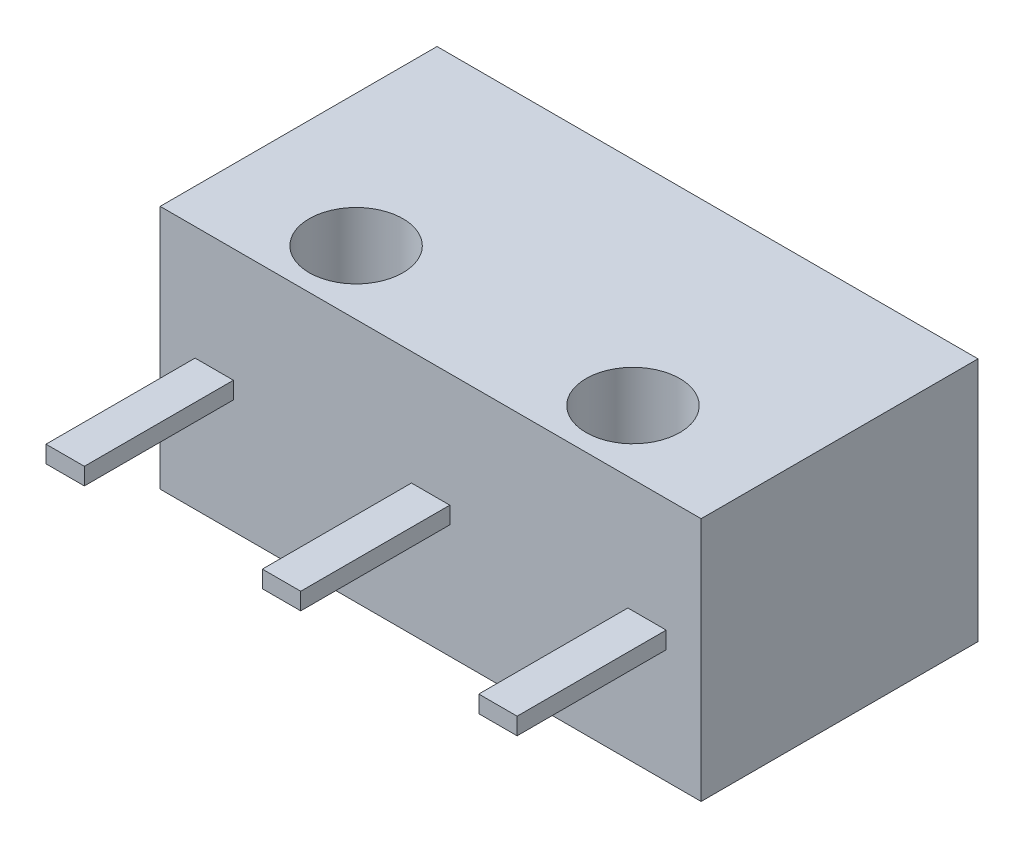
ISO-10303-21;
HEADER;
FILE_DESCRIPTION(('STEP AP214'),'2;1');
FILE_NAME('part.step','',(''),(''),'','','');
FILE_SCHEMA(('AUTOMOTIVE_DESIGN { 1 0 10303 214 1 1 1 1 }'));
ENDSEC;
DATA;
#1=APPLICATION_CONTEXT('core data for automotive mechanical design processes');
#2=APPLICATION_PROTOCOL_DEFINITION('international standard','automotive_design',2000,#1);
#3=PRODUCT_CONTEXT('',#1,'mechanical');
#4=PRODUCT('Part','Part','',(#3));
#5=PRODUCT_RELATED_PRODUCT_CATEGORY('part','',(#4));
#6=PRODUCT_DEFINITION_FORMATION('','',#4);
#7=PRODUCT_DEFINITION_CONTEXT('part definition',#1,'design');
#8=PRODUCT_DEFINITION('design','',#6,#7);
#9=PRODUCT_DEFINITION_SHAPE('','',#8);
#10=(LENGTH_UNIT() NAMED_UNIT(*) SI_UNIT(.MILLI.,.METRE.));
#11=(NAMED_UNIT(*) PLANE_ANGLE_UNIT() SI_UNIT($,.RADIAN.));
#12=(NAMED_UNIT(*) SI_UNIT($,.STERADIAN.) SOLID_ANGLE_UNIT());
#13=UNCERTAINTY_MEASURE_WITH_UNIT(LENGTH_MEASURE(1.E-05),#10,'distance_accuracy_value','');
#14=(GEOMETRIC_REPRESENTATION_CONTEXT(3) GLOBAL_UNCERTAINTY_ASSIGNED_CONTEXT((#13)) GLOBAL_UNIT_ASSIGNED_CONTEXT((#10,
#11,#12)) REPRESENTATION_CONTEXT('',''));
#15=CARTESIAN_POINT('',(0.,0.,0.));
#16=DIRECTION('',(0.,0.,1.));
#17=DIRECTION('',(1.,0.,0.));
#18=AXIS2_PLACEMENT_3D('',#15,#16,#17);
#19=CARTESIAN_POINT('',(0.,5.75,0.));
#20=DIRECTION('',(0.,0.,-1.));
#21=DIRECTION('',(-1.,0.,0.));
#22=AXIS2_PLACEMENT_3D('',#19,#20,#21);
#23=PLANE('',#22);
#24=DIRECTION('',(1.,0.,0.));
#25=VECTOR('',#24,1.);
#26=CARTESIAN_POINT('',(0.,0.,0.));
#27=LINE('',#26,#25);
#28=CARTESIAN_POINT('',(0.,0.,0.));
#29=VERTEX_POINT('',#28);
#30=CARTESIAN_POINT('',(12.7,0.,0.));
#31=VERTEX_POINT('',#30);
#32=EDGE_CURVE('E294',#29,#31,#27,.T.);
#33=ORIENTED_EDGE('',*,*,#32,.T.);
#34=DIRECTION('',(0.,-1.,0.));
#35=VECTOR('',#34,1.);
#36=CARTESIAN_POINT('',(12.7,5.75,0.));
#37=LINE('',#36,#35);
#38=CARTESIAN_POINT('',(12.7,5.75,0.));
#39=VERTEX_POINT('',#38);
#40=EDGE_CURVE('E41',#39,#31,#37,.T.);
#41=ORIENTED_EDGE('',*,*,#40,.F.);
#42=DIRECTION('',(1.,0.,0.));
#43=VECTOR('',#42,1.);
#44=CARTESIAN_POINT('',(0.,5.75,0.));
#45=LINE('',#44,#43);
#46=CARTESIAN_POINT('',(0.,5.75,0.));
#47=VERTEX_POINT('',#46);
#48=EDGE_CURVE('E284',#47,#39,#45,.T.);
#49=ORIENTED_EDGE('',*,*,#48,.F.);
#50=DIRECTION('',(0.,-1.,0.));
#51=VECTOR('',#50,1.);
#52=CARTESIAN_POINT('',(0.,5.75,0.));
#53=LINE('',#52,#51);
#54=EDGE_CURVE('E11',#47,#29,#53,.T.);
#55=ORIENTED_EDGE('',*,*,#54,.T.);
#56=EDGE_LOOP('',(#33,#41,#49,#55));
#57=FACE_BOUND('',#56,.T.);
#58=DIRECTION('',(0.,1.,0.));
#59=VECTOR('',#58,1.);
#60=CARTESIAN_POINT('',(6.8,2.675,0.));
#61=LINE('',#60,#59);
#62=CARTESIAN_POINT('',(6.8,2.675,0.));
#63=VERTEX_POINT('',#62);
#64=CARTESIAN_POINT('',(6.8,3.075,0.));
#65=VERTEX_POINT('',#64);
#66=EDGE_CURVE('E263',#63,#65,#61,.T.);
#67=ORIENTED_EDGE('',*,*,#66,.F.);
#68=DIRECTION('',(-1.,0.,0.));
#69=VECTOR('',#68,1.);
#70=CARTESIAN_POINT('',(5.9,2.675,0.));
#71=LINE('',#70,#69);
#72=CARTESIAN_POINT('',(5.9,2.675,0.));
#73=VERTEX_POINT('',#72);
#74=EDGE_CURVE('E257',#63,#73,#71,.T.);
#75=ORIENTED_EDGE('',*,*,#74,.T.);
#76=DIRECTION('',(0.,1.,0.));
#77=VECTOR('',#76,1.);
#78=CARTESIAN_POINT('',(5.9,2.675,0.));
#79=LINE('',#78,#77);
#80=CARTESIAN_POINT('',(5.9,3.075,0.));
#81=VERTEX_POINT('',#80);
#82=EDGE_CURVE('E260',#73,#81,#79,.T.);
#83=ORIENTED_EDGE('',*,*,#82,.T.);
#84=DIRECTION('',(-1.,0.,0.));
#85=VECTOR('',#84,1.);
#86=CARTESIAN_POINT('',(5.9,3.075,0.));
#87=LINE('',#86,#85);
#88=EDGE_CURVE('E245',#65,#81,#87,.T.);
#89=ORIENTED_EDGE('',*,*,#88,.F.);
#90=EDGE_LOOP('',(#67,#75,#83,#89));
#91=FACE_BOUND('',#90,.T.);
#92=DIRECTION('',(0.,1.,0.));
#93=VECTOR('',#92,1.);
#94=CARTESIAN_POINT('',(11.88,2.675,0.));
#95=LINE('',#94,#93);
#96=CARTESIAN_POINT('',(11.88,2.675,0.));
#97=VERTEX_POINT('',#96);
#98=CARTESIAN_POINT('',(11.88,3.075,0.));
#99=VERTEX_POINT('',#98);
#100=EDGE_CURVE('E233',#97,#99,#95,.T.);
#101=ORIENTED_EDGE('',*,*,#100,.F.);
#102=DIRECTION('',(-1.,0.,0.));
#103=VECTOR('',#102,1.);
#104=CARTESIAN_POINT('',(11.88,2.675,0.));
#105=LINE('',#104,#103);
#106=CARTESIAN_POINT('',(10.98,2.675,0.));
#107=VERTEX_POINT('',#106);
#108=EDGE_CURVE('E222',#97,#107,#105,.T.);
#109=ORIENTED_EDGE('',*,*,#108,.T.);
#110=DIRECTION('',(0.,1.,0.));
#111=VECTOR('',#110,1.);
#112=CARTESIAN_POINT('',(10.98,2.675,0.));
#113=LINE('',#112,#111);
#114=CARTESIAN_POINT('',(10.98,3.075,0.));
#115=VERTEX_POINT('',#114);
#116=EDGE_CURVE('E231',#107,#115,#113,.T.);
#117=ORIENTED_EDGE('',*,*,#116,.T.);
#118=DIRECTION('',(-1.,0.,0.));
#119=VECTOR('',#118,1.);
#120=CARTESIAN_POINT('',(11.88,3.075,0.));
#121=LINE('',#120,#119);
#122=EDGE_CURVE('E211',#99,#115,#121,.T.);
#123=ORIENTED_EDGE('',*,*,#122,.F.);
#124=EDGE_LOOP('',(#101,#109,#117,#123));
#125=FACE_BOUND('',#124,.T.);
#126=DIRECTION('',(-1.,0.,0.));
#127=VECTOR('',#126,1.);
#128=CARTESIAN_POINT('',(0.820000000000001,2.675,0.));
#129=LINE('',#128,#127);
#130=CARTESIAN_POINT('',(1.72,2.675,0.));
#131=VERTEX_POINT('',#130);
#132=CARTESIAN_POINT('',(0.820000000000001,2.675,0.));
#133=VERTEX_POINT('',#132);
#134=EDGE_CURVE('E192',#131,#133,#129,.T.);
#135=ORIENTED_EDGE('',*,*,#134,.T.);
#136=DIRECTION('',(0.,1.,0.));
#137=VECTOR('',#136,1.);
#138=CARTESIAN_POINT('',(0.820000000000001,2.675,0.));
#139=LINE('',#138,#137);
#140=CARTESIAN_POINT('',(0.820000000000001,3.075,0.));
#141=VERTEX_POINT('',#140);
#142=EDGE_CURVE('E196',#133,#141,#139,.T.);
#143=ORIENTED_EDGE('',*,*,#142,.T.);
#144=DIRECTION('',(-1.,0.,0.));
#145=VECTOR('',#144,1.);
#146=CARTESIAN_POINT('',(0.820000000000001,3.075,0.));
#147=LINE('',#146,#145);
#148=CARTESIAN_POINT('',(1.72,3.075,0.));
#149=VERTEX_POINT('',#148);
#150=EDGE_CURVE('E183',#149,#141,#147,.T.);
#151=ORIENTED_EDGE('',*,*,#150,.F.);
#152=DIRECTION('',(0.,1.,0.));
#153=VECTOR('',#152,1.);
#154=CARTESIAN_POINT('',(1.72,2.675,0.));
#155=LINE('',#154,#153);
#156=EDGE_CURVE('E200',#131,#149,#155,.T.);
#157=ORIENTED_EDGE('',*,*,#156,.F.);
#158=EDGE_LOOP('',(#135,#143,#151,#157));
#159=FACE_BOUND('',#158,.T.);
#160=ADVANCED_FACE('F33',(#57,#91,#125,#159),#23,.F.);
#161=CARTESIAN_POINT('',(0.,5.75,0.));
#162=DIRECTION('',(1.,0.,0.));
#163=DIRECTION('',(0.,0.,-1.));
#164=AXIS2_PLACEMENT_3D('',#161,#162,#163);
#165=PLANE('',#164);
#166=DIRECTION('',(0.,0.,1.));
#167=VECTOR('',#166,1.);
#168=CARTESIAN_POINT('',(0.,0.,0.));
#169=LINE('',#168,#167);
#170=CARTESIAN_POINT('',(0.,0.,-6.5));
#171=VERTEX_POINT('',#170);
#172=EDGE_CURVE('E272',#171,#29,#169,.T.);
#173=ORIENTED_EDGE('',*,*,#172,.T.);
#174=ORIENTED_EDGE('',*,*,#54,.F.);
#175=DIRECTION('',(0.,0.,1.));
#176=VECTOR('',#175,1.);
#177=CARTESIAN_POINT('',(0.,5.75,0.));
#178=LINE('',#177,#176);
#179=CARTESIAN_POINT('',(0.,5.75,-6.5));
#180=VERTEX_POINT('',#179);
#181=EDGE_CURVE('E281',#180,#47,#178,.T.);
#182=ORIENTED_EDGE('',*,*,#181,.F.);
#183=DIRECTION('',(0.,-1.,0.));
#184=VECTOR('',#183,1.);
#185=CARTESIAN_POINT('',(0.,5.75,-6.5));
#186=LINE('',#185,#184);
#187=EDGE_CURVE('E291',#180,#171,#186,.T.);
#188=ORIENTED_EDGE('',*,*,#187,.T.);
#189=EDGE_LOOP('',(#173,#174,#182,#188));
#190=FACE_BOUND('',#189,.T.);
#191=ADVANCED_FACE('F35',(#190),#165,.F.);
#192=CARTESIAN_POINT('',(12.7,5.75,0.));
#193=DIRECTION('',(-1.,0.,0.));
#194=DIRECTION('',(0.,0.,1.));
#195=AXIS2_PLACEMENT_3D('',#192,#193,#194);
#196=PLANE('',#195);
#197=DIRECTION('',(0.,0.,-1.));
#198=VECTOR('',#197,1.);
#199=CARTESIAN_POINT('',(12.7,0.,0.));
#200=LINE('',#199,#198);
#201=CARTESIAN_POINT('',(12.7,0.,-6.5));
#202=VERTEX_POINT('',#201);
#203=EDGE_CURVE('E296',#31,#202,#200,.T.);
#204=ORIENTED_EDGE('',*,*,#203,.T.);
#205=DIRECTION('',(0.,-1.,0.));
#206=VECTOR('',#205,1.);
#207=CARTESIAN_POINT('',(12.7,5.75,-6.5));
#208=LINE('',#207,#206);
#209=CARTESIAN_POINT('',(12.7,5.75,-6.5));
#210=VERTEX_POINT('',#209);
#211=EDGE_CURVE('E301',#210,#202,#208,.T.);
#212=ORIENTED_EDGE('',*,*,#211,.F.);
#213=DIRECTION('',(0.,0.,-1.));
#214=VECTOR('',#213,1.);
#215=CARTESIAN_POINT('',(12.7,5.75,0.));
#216=LINE('',#215,#214);
#217=EDGE_CURVE('E287',#39,#210,#216,.T.);
#218=ORIENTED_EDGE('',*,*,#217,.F.);
#219=ORIENTED_EDGE('',*,*,#40,.T.);
#220=EDGE_LOOP('',(#204,#212,#218,#219));
#221=FACE_BOUND('',#220,.T.);
#222=ADVANCED_FACE('F308',(#221),#196,.F.);
#223=CARTESIAN_POINT('',(0.,5.75,-6.5));
#224=DIRECTION('',(0.,0.,1.));
#225=DIRECTION('',(1.,0.,0.));
#226=AXIS2_PLACEMENT_3D('',#223,#224,#225);
#227=PLANE('',#226);
#228=DIRECTION('',(0.,1.,0.));
#229=VECTOR('',#228,1.);
#230=CARTESIAN_POINT('',(3.8,1.425,-6.5));
#231=LINE('',#230,#229);
#232=CARTESIAN_POINT('',(3.8,1.425,-6.5));
#233=VERTEX_POINT('',#232);
#234=CARTESIAN_POINT('',(3.8,4.325,-6.5));
#235=VERTEX_POINT('',#234);
#236=EDGE_CURVE('E53',#233,#235,#231,.T.);
#237=ORIENTED_EDGE('',*,*,#236,.F.);
#238=DIRECTION('',(1.,0.,0.));
#239=VECTOR('',#238,1.);
#240=CARTESIAN_POINT('',(3.8,1.425,-6.5));
#241=LINE('',#240,#239);
#242=CARTESIAN_POINT('',(5.,1.425,-6.5));
#243=VERTEX_POINT('',#242);
#244=EDGE_CURVE('E48',#233,#243,#241,.T.);
#245=ORIENTED_EDGE('',*,*,#244,.T.);
#246=DIRECTION('',(0.,1.,0.));
#247=VECTOR('',#246,1.);
#248=CARTESIAN_POINT('',(5.,1.425,-6.5));
#249=LINE('',#248,#247);
#250=CARTESIAN_POINT('',(5.,4.325,-6.5));
#251=VERTEX_POINT('',#250);
#252=EDGE_CURVE('E154',#243,#251,#249,.T.);
#253=ORIENTED_EDGE('',*,*,#252,.T.);
#254=DIRECTION('',(1.,0.,0.));
#255=VECTOR('',#254,1.);
#256=CARTESIAN_POINT('',(3.8,4.325,-6.5));
#257=LINE('',#256,#255);
#258=EDGE_CURVE('E158',#235,#251,#257,.T.);
#259=ORIENTED_EDGE('',*,*,#258,.F.);
#260=EDGE_LOOP('',(#237,#245,#253,#259));
#261=FACE_BOUND('',#260,.T.);
#262=DIRECTION('',(-1.,0.,0.));
#263=VECTOR('',#262,1.);
#264=CARTESIAN_POINT('',(0.,0.,-6.5));
#265=LINE('',#264,#263);
#266=EDGE_CURVE('E285',#202,#171,#265,.T.);
#267=ORIENTED_EDGE('',*,*,#266,.T.);
#268=ORIENTED_EDGE('',*,*,#187,.F.);
#269=DIRECTION('',(-1.,0.,0.));
#270=VECTOR('',#269,1.);
#271=CARTESIAN_POINT('',(0.,5.75,-6.5));
#272=LINE('',#271,#270);
#273=EDGE_CURVE('E289',#210,#180,#272,.T.);
#274=ORIENTED_EDGE('',*,*,#273,.F.);
#275=ORIENTED_EDGE('',*,*,#211,.T.);
#276=EDGE_LOOP('',(#267,#268,#274,#275));
#277=FACE_BOUND('',#276,.T.);
#278=ADVANCED_FACE('F156',(#261,#277),#227,.F.);
#279=CARTESIAN_POINT('',(0.,5.75,0.));
#280=DIRECTION('',(0.,-1.,0.));
#281=DIRECTION('',(0.,0.,-1.));
#282=AXIS2_PLACEMENT_3D('',#279,#280,#281);
#283=PLANE('',#282);
#284=CARTESIAN_POINT('',(3.1,5.75,-1.5));
#285=DIRECTION('',(0.,1.,0.));
#286=DIRECTION('',(0.,0.,1.));
#287=AXIS2_PLACEMENT_3D('',#284,#285,#286);
#288=CIRCLE('',#287,1.1);
#289=CARTESIAN_POINT('',(3.1,5.75,-0.4));
#290=VERTEX_POINT('',#289);
#291=EDGE_CURVE('E273',#290,#290,#288,.T.);
#292=ORIENTED_EDGE('',*,*,#291,.F.);
#293=EDGE_LOOP('',(#292));
#294=FACE_BOUND('',#293,.T.);
#295=CARTESIAN_POINT('',(9.6,5.75,-1.5));
#296=DIRECTION('',(0.,1.,0.));
#297=DIRECTION('',(0.,0.,1.));
#298=AXIS2_PLACEMENT_3D('',#295,#296,#297);
#299=CIRCLE('',#298,1.1);
#300=CARTESIAN_POINT('',(9.6,5.75,-0.4));
#301=VERTEX_POINT('',#300);
#302=EDGE_CURVE('E262',#301,#301,#299,.T.);
#303=ORIENTED_EDGE('',*,*,#302,.F.);
#304=EDGE_LOOP('',(#303));
#305=FACE_BOUND('',#304,.T.);
#306=ORIENTED_EDGE('',*,*,#181,.T.);
#307=ORIENTED_EDGE('',*,*,#48,.T.);
#308=ORIENTED_EDGE('',*,*,#217,.T.);
#309=ORIENTED_EDGE('',*,*,#273,.T.);
#310=EDGE_LOOP('',(#306,#307,#308,#309));
#311=FACE_BOUND('',#310,.T.);
#312=ADVANCED_FACE('F321',(#294,#305,#311),#283,.F.);
#313=CARTESIAN_POINT('',(0.,0.,0.));
#314=DIRECTION('',(0.,-1.,0.));
#315=DIRECTION('',(0.,0.,-1.));
#316=AXIS2_PLACEMENT_3D('',#313,#314,#315);
#317=PLANE('',#316);
#318=CARTESIAN_POINT('',(3.1,0.,-1.5));
#319=DIRECTION('',(0.,1.,0.));
#320=DIRECTION('',(0.,0.,1.));
#321=AXIS2_PLACEMENT_3D('',#318,#319,#320);
#322=CIRCLE('',#321,1.1);
#323=CARTESIAN_POINT('',(3.1,0.,-0.4));
#324=VERTEX_POINT('',#323);
#325=EDGE_CURVE('E269',#324,#324,#322,.T.);
#326=ORIENTED_EDGE('',*,*,#325,.T.);
#327=EDGE_LOOP('',(#326));
#328=FACE_BOUND('',#327,.T.);
#329=CARTESIAN_POINT('',(9.6,0.,-1.5));
#330=DIRECTION('',(0.,1.,0.));
#331=DIRECTION('',(0.,0.,1.));
#332=AXIS2_PLACEMENT_3D('',#329,#330,#331);
#333=CIRCLE('',#332,1.1);
#334=CARTESIAN_POINT('',(9.6,0.,-0.4));
#335=VERTEX_POINT('',#334);
#336=EDGE_CURVE('E276',#335,#335,#333,.T.);
#337=ORIENTED_EDGE('',*,*,#336,.T.);
#338=EDGE_LOOP('',(#337));
#339=FACE_BOUND('',#338,.T.);
#340=ORIENTED_EDGE('',*,*,#172,.F.);
#341=ORIENTED_EDGE('',*,*,#266,.F.);
#342=ORIENTED_EDGE('',*,*,#203,.F.);
#343=ORIENTED_EDGE('',*,*,#32,.F.);
#344=EDGE_LOOP('',(#340,#341,#342,#343));
#345=FACE_BOUND('',#344,.T.);
#346=ADVANCED_FACE('F314',(#328,#339,#345),#317,.T.);
#347=CARTESIAN_POINT('',(9.6,0.,-1.5));
#348=DIRECTION('',(0.,1.,0.));
#349=DIRECTION('',(0.,0.,1.));
#350=AXIS2_PLACEMENT_3D('',#347,#348,#349);
#351=CYLINDRICAL_SURFACE('',#350,1.1);
#352=ORIENTED_EDGE('',*,*,#336,.F.);
#353=EDGE_LOOP('',(#352));
#354=FACE_BOUND('',#353,.T.);
#355=ORIENTED_EDGE('',*,*,#302,.T.);
#356=EDGE_LOOP('',(#355));
#357=FACE_BOUND('',#356,.T.);
#358=ADVANCED_FACE('F401',(#354,#357),#351,.F.);
#359=CARTESIAN_POINT('',(3.1,0.,-1.5));
#360=DIRECTION('',(0.,1.,0.));
#361=DIRECTION('',(0.,0.,1.));
#362=AXIS2_PLACEMENT_3D('',#359,#360,#361);
#363=CYLINDRICAL_SURFACE('',#362,1.1);
#364=ORIENTED_EDGE('',*,*,#325,.F.);
#365=EDGE_LOOP('',(#364));
#366=FACE_BOUND('',#365,.T.);
#367=ORIENTED_EDGE('',*,*,#291,.T.);
#368=EDGE_LOOP('',(#367));
#369=FACE_BOUND('',#368,.T.);
#370=ADVANCED_FACE('F397',(#366,#369),#363,.F.);
#371=CARTESIAN_POINT('',(5.9,2.675,3.5));
#372=DIRECTION('',(-1.,0.,0.));
#373=DIRECTION('',(0.,0.,1.));
#374=AXIS2_PLACEMENT_3D('',#371,#372,#373);
#375=PLANE('',#374);
#376=DIRECTION('',(0.,1.,0.));
#377=VECTOR('',#376,1.);
#378=CARTESIAN_POINT('',(5.9,2.675,3.5));
#379=LINE('',#378,#377);
#380=CARTESIAN_POINT('',(5.9,2.675,3.5));
#381=VERTEX_POINT('',#380);
#382=CARTESIAN_POINT('',(5.9,3.075,3.5));
#383=VERTEX_POINT('',#382);
#384=EDGE_CURVE('E259',#381,#383,#379,.T.);
#385=ORIENTED_EDGE('',*,*,#384,.T.);
#386=DIRECTION('',(0.,0.,1.));
#387=VECTOR('',#386,1.);
#388=CARTESIAN_POINT('',(5.9,3.075,3.5));
#389=LINE('',#388,#387);
#390=EDGE_CURVE('E230',#81,#383,#389,.T.);
#391=ORIENTED_EDGE('',*,*,#390,.F.);
#392=ORIENTED_EDGE('',*,*,#82,.F.);
#393=DIRECTION('',(0.,0.,1.));
#394=VECTOR('',#393,1.);
#395=CARTESIAN_POINT('',(5.9,2.675,3.5));
#396=LINE('',#395,#394);
#397=EDGE_CURVE('E248',#73,#381,#396,.T.);
#398=ORIENTED_EDGE('',*,*,#397,.T.);
#399=EDGE_LOOP('',(#385,#391,#392,#398));
#400=FACE_BOUND('',#399,.T.);
#401=ADVANCED_FACE('F390',(#400),#375,.T.);
#402=CARTESIAN_POINT('',(6.8,2.675,3.5));
#403=DIRECTION('',(1.,0.,0.));
#404=DIRECTION('',(0.,0.,-1.));
#405=AXIS2_PLACEMENT_3D('',#402,#403,#404);
#406=PLANE('',#405);
#407=ORIENTED_EDGE('',*,*,#66,.T.);
#408=DIRECTION('',(0.,0.,-1.));
#409=VECTOR('',#408,1.);
#410=CARTESIAN_POINT('',(6.8,3.075,3.5));
#411=LINE('',#410,#409);
#412=CARTESIAN_POINT('',(6.8,3.075,3.5));
#413=VERTEX_POINT('',#412);
#414=EDGE_CURVE('E242',#413,#65,#411,.T.);
#415=ORIENTED_EDGE('',*,*,#414,.F.);
#416=DIRECTION('',(0.,1.,0.));
#417=VECTOR('',#416,1.);
#418=CARTESIAN_POINT('',(6.8,2.675,3.5));
#419=LINE('',#418,#417);
#420=CARTESIAN_POINT('',(6.8,2.675,3.5));
#421=VERTEX_POINT('',#420);
#422=EDGE_CURVE('E266',#421,#413,#419,.T.);
#423=ORIENTED_EDGE('',*,*,#422,.F.);
#424=DIRECTION('',(0.,0.,-1.));
#425=VECTOR('',#424,1.);
#426=CARTESIAN_POINT('',(6.8,2.675,3.5));
#427=LINE('',#426,#425);
#428=EDGE_CURVE('E254',#421,#63,#427,.T.);
#429=ORIENTED_EDGE('',*,*,#428,.T.);
#430=EDGE_LOOP('',(#407,#415,#423,#429));
#431=FACE_BOUND('',#430,.T.);
#432=ADVANCED_FACE('F387',(#431),#406,.T.);
#433=CARTESIAN_POINT('',(5.9,2.675,3.5));
#434=DIRECTION('',(0.,0.,1.));
#435=DIRECTION('',(1.,0.,0.));
#436=AXIS2_PLACEMENT_3D('',#433,#434,#435);
#437=PLANE('',#436);
#438=ORIENTED_EDGE('',*,*,#422,.T.);
#439=DIRECTION('',(1.,0.,0.));
#440=VECTOR('',#439,1.);
#441=CARTESIAN_POINT('',(5.9,3.075,3.5));
#442=LINE('',#441,#440);
#443=EDGE_CURVE('E239',#383,#413,#442,.T.);
#444=ORIENTED_EDGE('',*,*,#443,.F.);
#445=ORIENTED_EDGE('',*,*,#384,.F.);
#446=DIRECTION('',(1.,0.,0.));
#447=VECTOR('',#446,1.);
#448=CARTESIAN_POINT('',(5.9,2.675,3.5));
#449=LINE('',#448,#447);
#450=EDGE_CURVE('E251',#381,#421,#449,.T.);
#451=ORIENTED_EDGE('',*,*,#450,.T.);
#452=EDGE_LOOP('',(#438,#444,#445,#451));
#453=FACE_BOUND('',#452,.T.);
#454=ADVANCED_FACE('F385',(#453),#437,.T.);
#455=CARTESIAN_POINT('',(0.,2.675,0.));
#456=DIRECTION('',(0.,-1.,0.));
#457=DIRECTION('',(0.,0.,-1.));
#458=AXIS2_PLACEMENT_3D('',#455,#456,#457);
#459=PLANE('',#458);
#460=ORIENTED_EDGE('',*,*,#397,.F.);
#461=ORIENTED_EDGE('',*,*,#74,.F.);
#462=ORIENTED_EDGE('',*,*,#428,.F.);
#463=ORIENTED_EDGE('',*,*,#450,.F.);
#464=EDGE_LOOP('',(#460,#461,#462,#463));
#465=FACE_BOUND('',#464,.T.);
#466=ADVANCED_FACE('F381',(#465),#459,.T.);
#467=CARTESIAN_POINT('',(0.,3.075,0.));
#468=DIRECTION('',(0.,-1.,0.));
#469=DIRECTION('',(0.,0.,-1.));
#470=AXIS2_PLACEMENT_3D('',#467,#468,#469);
#471=PLANE('',#470);
#472=ORIENTED_EDGE('',*,*,#390,.T.);
#473=ORIENTED_EDGE('',*,*,#443,.T.);
#474=ORIENTED_EDGE('',*,*,#414,.T.);
#475=ORIENTED_EDGE('',*,*,#88,.T.);
#476=EDGE_LOOP('',(#472,#473,#474,#475));
#477=FACE_BOUND('',#476,.T.);
#478=ADVANCED_FACE('F371',(#477),#471,.F.);
#479=CARTESIAN_POINT('',(10.98,2.675,3.5));
#480=DIRECTION('',(-1.,0.,0.));
#481=DIRECTION('',(0.,0.,1.));
#482=AXIS2_PLACEMENT_3D('',#479,#480,#481);
#483=PLANE('',#482);
#484=DIRECTION('',(0.,1.,0.));
#485=VECTOR('',#484,1.);
#486=CARTESIAN_POINT('',(10.98,2.675,3.5));
#487=LINE('',#486,#485);
#488=CARTESIAN_POINT('',(10.98,2.675,3.5));
#489=VERTEX_POINT('',#488);
#490=CARTESIAN_POINT('',(10.98,3.075,3.5));
#491=VERTEX_POINT('',#490);
#492=EDGE_CURVE('E228',#489,#491,#487,.T.);
#493=ORIENTED_EDGE('',*,*,#492,.T.);
#494=DIRECTION('',(0.,0.,1.));
#495=VECTOR('',#494,1.);
#496=CARTESIAN_POINT('',(10.98,3.075,3.5));
#497=LINE('',#496,#495);
#498=EDGE_CURVE('E214',#115,#491,#497,.T.);
#499=ORIENTED_EDGE('',*,*,#498,.F.);
#500=ORIENTED_EDGE('',*,*,#116,.F.);
#501=DIRECTION('',(0.,0.,1.));
#502=VECTOR('',#501,1.);
#503=CARTESIAN_POINT('',(10.98,2.675,3.5));
#504=LINE('',#503,#502);
#505=EDGE_CURVE('E224',#107,#489,#504,.T.);
#506=ORIENTED_EDGE('',*,*,#505,.T.);
#507=EDGE_LOOP('',(#493,#499,#500,#506));
#508=FACE_BOUND('',#507,.T.);
#509=ADVANCED_FACE('F367',(#508),#483,.T.);
#510=CARTESIAN_POINT('',(11.88,2.675,0.));
#511=DIRECTION('',(1.,0.,0.));
#512=DIRECTION('',(0.,0.,-1.));
#513=AXIS2_PLACEMENT_3D('',#510,#511,#512);
#514=PLANE('',#513);
#515=ORIENTED_EDGE('',*,*,#100,.T.);
#516=DIRECTION('',(0.,0.,-1.));
#517=VECTOR('',#516,1.);
#518=CARTESIAN_POINT('',(11.88,3.075,0.));
#519=LINE('',#518,#517);
#520=CARTESIAN_POINT('',(11.88,3.075,3.5));
#521=VERTEX_POINT('',#520);
#522=EDGE_CURVE('E208',#521,#99,#519,.T.);
#523=ORIENTED_EDGE('',*,*,#522,.F.);
#524=DIRECTION('',(0.,1.,0.));
#525=VECTOR('',#524,1.);
#526=CARTESIAN_POINT('',(11.88,2.675,3.5));
#527=LINE('',#526,#525);
#528=CARTESIAN_POINT('',(11.88,2.675,3.5));
#529=VERTEX_POINT('',#528);
#530=EDGE_CURVE('E227',#529,#521,#527,.T.);
#531=ORIENTED_EDGE('',*,*,#530,.F.);
#532=DIRECTION('',(0.,0.,-1.));
#533=VECTOR('',#532,1.);
#534=CARTESIAN_POINT('',(11.88,2.675,0.));
#535=LINE('',#534,#533);
#536=EDGE_CURVE('E219',#529,#97,#535,.T.);
#537=ORIENTED_EDGE('',*,*,#536,.T.);
#538=EDGE_LOOP('',(#515,#523,#531,#537));
#539=FACE_BOUND('',#538,.T.);
#540=ADVANCED_FACE('F370',(#539),#514,.T.);
#541=CARTESIAN_POINT('',(11.88,2.675,3.5));
#542=DIRECTION('',(0.,0.,1.));
#543=DIRECTION('',(1.,0.,0.));
#544=AXIS2_PLACEMENT_3D('',#541,#542,#543);
#545=PLANE('',#544);
#546=ORIENTED_EDGE('',*,*,#530,.T.);
#547=DIRECTION('',(1.,0.,0.));
#548=VECTOR('',#547,1.);
#549=CARTESIAN_POINT('',(11.43,3.075,3.5));
#550=LINE('',#549,#548);
#551=EDGE_CURVE('E199',#491,#521,#550,.T.);
#552=ORIENTED_EDGE('',*,*,#551,.F.);
#553=ORIENTED_EDGE('',*,*,#492,.F.);
#554=DIRECTION('',(1.,0.,0.));
#555=VECTOR('',#554,1.);
#556=CARTESIAN_POINT('',(11.43,2.675,3.5));
#557=LINE('',#556,#555);
#558=EDGE_CURVE('E217',#489,#529,#557,.T.);
#559=ORIENTED_EDGE('',*,*,#558,.T.);
#560=EDGE_LOOP('',(#546,#552,#553,#559));
#561=FACE_BOUND('',#560,.T.);
#562=ADVANCED_FACE('F365',(#561),#545,.T.);
#563=CARTESIAN_POINT('',(0.,2.675,0.));
#564=DIRECTION('',(0.,-1.,0.));
#565=DIRECTION('',(0.,0.,-1.));
#566=AXIS2_PLACEMENT_3D('',#563,#564,#565);
#567=PLANE('',#566);
#568=ORIENTED_EDGE('',*,*,#558,.F.);
#569=ORIENTED_EDGE('',*,*,#505,.F.);
#570=ORIENTED_EDGE('',*,*,#108,.F.);
#571=ORIENTED_EDGE('',*,*,#536,.F.);
#572=EDGE_LOOP('',(#568,#569,#570,#571));
#573=FACE_BOUND('',#572,.T.);
#574=ADVANCED_FACE('F361',(#573),#567,.T.);
#575=CARTESIAN_POINT('',(0.,3.075,0.));
#576=DIRECTION('',(0.,-1.,0.));
#577=DIRECTION('',(0.,0.,-1.));
#578=AXIS2_PLACEMENT_3D('',#575,#576,#577);
#579=PLANE('',#578);
#580=ORIENTED_EDGE('',*,*,#551,.T.);
#581=ORIENTED_EDGE('',*,*,#522,.T.);
#582=ORIENTED_EDGE('',*,*,#122,.T.);
#583=ORIENTED_EDGE('',*,*,#498,.T.);
#584=EDGE_LOOP('',(#580,#581,#582,#583));
#585=FACE_BOUND('',#584,.T.);
#586=ADVANCED_FACE('F358',(#585),#579,.F.);
#587=CARTESIAN_POINT('',(0.820000000000001,2.675,0.));
#588=DIRECTION('',(-1.,0.,0.));
#589=DIRECTION('',(0.,0.,1.));
#590=AXIS2_PLACEMENT_3D('',#587,#588,#589);
#591=PLANE('',#590);
#592=DIRECTION('',(0.,1.,0.));
#593=VECTOR('',#592,1.);
#594=CARTESIAN_POINT('',(0.820000000000001,2.675,3.5));
#595=LINE('',#594,#593);
#596=CARTESIAN_POINT('',(0.820000000000001,2.675,3.5));
#597=VERTEX_POINT('',#596);
#598=CARTESIAN_POINT('',(0.820000000000001,3.075,3.5));
#599=VERTEX_POINT('',#598);
#600=EDGE_CURVE('E195',#597,#599,#595,.T.);
#601=ORIENTED_EDGE('',*,*,#600,.T.);
#602=DIRECTION('',(0.,0.,1.));
#603=VECTOR('',#602,1.);
#604=CARTESIAN_POINT('',(0.820000000000001,3.075,0.));
#605=LINE('',#604,#603);
#606=EDGE_CURVE('E162',#141,#599,#605,.T.);
#607=ORIENTED_EDGE('',*,*,#606,.F.);
#608=ORIENTED_EDGE('',*,*,#142,.F.);
#609=DIRECTION('',(0.,0.,1.));
#610=VECTOR('',#609,1.);
#611=CARTESIAN_POINT('',(0.820000000000001,2.675,0.));
#612=LINE('',#611,#610);
#613=EDGE_CURVE('E185',#133,#597,#612,.T.);
#614=ORIENTED_EDGE('',*,*,#613,.T.);
#615=EDGE_LOOP('',(#601,#607,#608,#614));
#616=FACE_BOUND('',#615,.T.);
#617=ADVANCED_FACE('F336',(#616),#591,.T.);
#618=CARTESIAN_POINT('',(1.72,2.675,3.5));
#619=DIRECTION('',(1.,0.,0.));
#620=DIRECTION('',(0.,0.,-1.));
#621=AXIS2_PLACEMENT_3D('',#618,#619,#620);
#622=PLANE('',#621);
#623=ORIENTED_EDGE('',*,*,#156,.T.);
#624=DIRECTION('',(0.,0.,-1.));
#625=VECTOR('',#624,1.);
#626=CARTESIAN_POINT('',(1.72,3.075,3.5));
#627=LINE('',#626,#625);
#628=CARTESIAN_POINT('',(1.72,3.075,3.5));
#629=VERTEX_POINT('',#628);
#630=EDGE_CURVE('E181',#629,#149,#627,.T.);
#631=ORIENTED_EDGE('',*,*,#630,.F.);
#632=DIRECTION('',(0.,1.,0.));
#633=VECTOR('',#632,1.);
#634=CARTESIAN_POINT('',(1.72,2.675,3.5));
#635=LINE('',#634,#633);
#636=CARTESIAN_POINT('',(1.72,2.675,3.5));
#637=VERTEX_POINT('',#636);
#638=EDGE_CURVE('E203',#637,#629,#635,.T.);
#639=ORIENTED_EDGE('',*,*,#638,.F.);
#640=DIRECTION('',(0.,0.,-1.));
#641=VECTOR('',#640,1.);
#642=CARTESIAN_POINT('',(1.72,2.675,3.5));
#643=LINE('',#642,#641);
#644=EDGE_CURVE('E190',#637,#131,#643,.T.);
#645=ORIENTED_EDGE('',*,*,#644,.T.);
#646=EDGE_LOOP('',(#623,#631,#639,#645));
#647=FACE_BOUND('',#646,.T.);
#648=ADVANCED_FACE('F344',(#647),#622,.T.);
#649=CARTESIAN_POINT('',(1.27,2.675,3.5));
#650=DIRECTION('',(0.,0.,1.));
#651=DIRECTION('',(1.,0.,0.));
#652=AXIS2_PLACEMENT_3D('',#649,#650,#651);
#653=PLANE('',#652);
#654=ORIENTED_EDGE('',*,*,#638,.T.);
#655=DIRECTION('',(1.,0.,0.));
#656=VECTOR('',#655,1.);
#657=CARTESIAN_POINT('',(0.820000000000001,3.075,3.5));
#658=LINE('',#657,#656);
#659=EDGE_CURVE('E178',#599,#629,#658,.T.);
#660=ORIENTED_EDGE('',*,*,#659,.F.);
#661=ORIENTED_EDGE('',*,*,#600,.F.);
#662=DIRECTION('',(1.,0.,0.));
#663=VECTOR('',#662,1.);
#664=CARTESIAN_POINT('',(0.820000000000001,2.675,3.5));
#665=LINE('',#664,#663);
#666=EDGE_CURVE('E188',#597,#637,#665,.T.);
#667=ORIENTED_EDGE('',*,*,#666,.T.);
#668=EDGE_LOOP('',(#654,#660,#661,#667));
#669=FACE_BOUND('',#668,.T.);
#670=ADVANCED_FACE('F346',(#669),#653,.T.);
#671=CARTESIAN_POINT('',(0.,2.675,0.));
#672=DIRECTION('',(0.,1.,0.));
#673=DIRECTION('',(0.,0.,1.));
#674=AXIS2_PLACEMENT_3D('',#671,#672,#673);
#675=PLANE('',#674);
#676=ORIENTED_EDGE('',*,*,#613,.F.);
#677=ORIENTED_EDGE('',*,*,#134,.F.);
#678=ORIENTED_EDGE('',*,*,#644,.F.);
#679=ORIENTED_EDGE('',*,*,#666,.F.);
#680=EDGE_LOOP('',(#676,#677,#678,#679));
#681=FACE_BOUND('',#680,.T.);
#682=ADVANCED_FACE('F333',(#681),#675,.F.);
#683=CARTESIAN_POINT('',(0.,3.075,0.));
#684=DIRECTION('',(0.,1.,0.));
#685=DIRECTION('',(0.,0.,1.));
#686=AXIS2_PLACEMENT_3D('',#683,#684,#685);
#687=PLANE('',#686);
#688=ORIENTED_EDGE('',*,*,#606,.T.);
#689=ORIENTED_EDGE('',*,*,#659,.T.);
#690=ORIENTED_EDGE('',*,*,#630,.T.);
#691=ORIENTED_EDGE('',*,*,#150,.T.);
#692=EDGE_LOOP('',(#688,#689,#690,#691));
#693=FACE_BOUND('',#692,.T.);
#694=ADVANCED_FACE('F340',(#693),#687,.T.);
#695=CARTESIAN_POINT('',(4.4,1.425,-6.5));
#696=DIRECTION('',(0.,1.,0.));
#697=DIRECTION('',(0.,0.,1.));
#698=AXIS2_PLACEMENT_3D('',#695,#696,#697);
#699=CYLINDRICAL_SURFACE('',#698,0.6);
#700=ORIENTED_EDGE('',*,*,#236,.T.);
#701=CARTESIAN_POINT('',(4.4,4.325,-6.5));
#702=DIRECTION('',(0.,1.,0.));
#703=DIRECTION('',(0.,0.,-1.));
#704=AXIS2_PLACEMENT_3D('',#701,#702,#703);
#705=CIRCLE('',#704,0.6);
#706=EDGE_CURVE('E167',#251,#235,#705,.T.);
#707=ORIENTED_EDGE('',*,*,#706,.F.);
#708=ORIENTED_EDGE('',*,*,#252,.F.);
#709=CARTESIAN_POINT('',(4.4,1.425,-6.5));
#710=DIRECTION('',(0.,1.,0.));
#711=DIRECTION('',(0.,0.,-1.));
#712=AXIS2_PLACEMENT_3D('',#709,#710,#711);
#713=CIRCLE('',#712,0.6);
#714=EDGE_CURVE('E168',#243,#233,#713,.T.);
#715=ORIENTED_EDGE('',*,*,#714,.T.);
#716=EDGE_LOOP('',(#700,#707,#708,#715));
#717=FACE_BOUND('',#716,.T.);
#718=ADVANCED_FACE('F170',(#717),#699,.T.);
#719=CARTESIAN_POINT('',(4.4,1.425,-6.5));
#720=DIRECTION('',(0.,-1.,0.));
#721=DIRECTION('',(0.,0.,-1.));
#722=AXIS2_PLACEMENT_3D('',#719,#720,#721);
#723=PLANE('',#722);
#724=ORIENTED_EDGE('',*,*,#714,.F.);
#725=ORIENTED_EDGE('',*,*,#244,.F.);
#726=EDGE_LOOP('',(#724,#725));
#727=FACE_BOUND('',#726,.T.);
#728=ADVANCED_FACE('F537',(#727),#723,.T.);
#729=CARTESIAN_POINT('',(4.4,4.325,-6.5));
#730=DIRECTION('',(0.,-1.,0.));
#731=DIRECTION('',(0.,0.,-1.));
#732=AXIS2_PLACEMENT_3D('',#729,#730,#731);
#733=PLANE('',#732);
#734=ORIENTED_EDGE('',*,*,#706,.T.);
#735=ORIENTED_EDGE('',*,*,#258,.T.);
#736=EDGE_LOOP('',(#734,#735));
#737=FACE_BOUND('',#736,.T.);
#738=ADVANCED_FACE('F166',(#737),#733,.F.);
#739=CLOSED_SHELL('',(#160,#191,#222,#278,#312,#346,#358,#370,#401,#432,#454,#466,#478,#509,
#540,#562,#574,#586,#617,#648,#670,#682,#694,#718,#728,#738));
#740=MANIFOLD_SOLID_BREP('B2',#739);
#741=ADVANCED_BREP_SHAPE_REPRESENTATION('',(#18,#740),#14);
#742=SHAPE_DEFINITION_REPRESENTATION(#9,#741);
ENDSEC;
END-ISO-10303-21;
